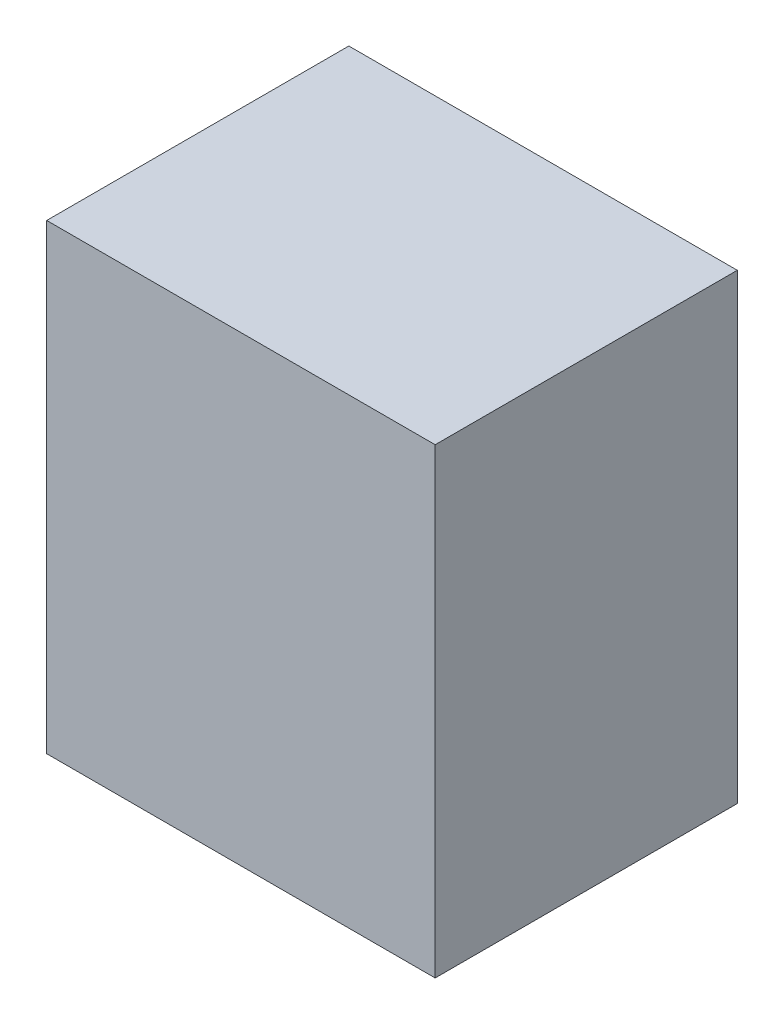
ISO-10303-21;
HEADER;
FILE_DESCRIPTION(('STEP AP214'),'2;1');
FILE_NAME('part.step','',(''),(''),'','','');
FILE_SCHEMA(('AUTOMOTIVE_DESIGN { 1 0 10303 214 1 1 1 1 }'));
ENDSEC;
DATA;
#1=APPLICATION_CONTEXT('core data for automotive mechanical design processes');
#2=APPLICATION_PROTOCOL_DEFINITION('international standard','automotive_design',2000,#1);
#3=PRODUCT_CONTEXT('',#1,'mechanical');
#4=PRODUCT('Part','Part','',(#3));
#5=PRODUCT_RELATED_PRODUCT_CATEGORY('part','',(#4));
#6=PRODUCT_DEFINITION_FORMATION('','',#4);
#7=PRODUCT_DEFINITION_CONTEXT('part definition',#1,'design');
#8=PRODUCT_DEFINITION('design','',#6,#7);
#9=PRODUCT_DEFINITION_SHAPE('','',#8);
#10=(LENGTH_UNIT() NAMED_UNIT(*) SI_UNIT(.MILLI.,.METRE.));
#11=(NAMED_UNIT(*) PLANE_ANGLE_UNIT() SI_UNIT($,.RADIAN.));
#12=(NAMED_UNIT(*) SI_UNIT($,.STERADIAN.) SOLID_ANGLE_UNIT());
#13=UNCERTAINTY_MEASURE_WITH_UNIT(LENGTH_MEASURE(1.E-05),#10,'distance_accuracy_value','');
#14=(GEOMETRIC_REPRESENTATION_CONTEXT(3) GLOBAL_UNCERTAINTY_ASSIGNED_CONTEXT((#13)) GLOBAL_UNIT_ASSIGNED_CONTEXT((#10,
#11,#12)) REPRESENTATION_CONTEXT('',''));
#15=CARTESIAN_POINT('',(0.,0.,0.));
#16=DIRECTION('',(0.,0.,1.));
#17=DIRECTION('',(1.,0.,0.));
#18=AXIS2_PLACEMENT_3D('',#15,#16,#17);
#19=CARTESIAN_POINT('',(0.,107.,0.));
#20=DIRECTION('',(1.,0.,0.));
#21=DIRECTION('',(0.,0.,-1.));
#22=AXIS2_PLACEMENT_3D('',#19,#20,#21);
#23=PLANE('',#22);
#24=DIRECTION('',(0.,0.,1.));
#25=VECTOR('',#24,1.);
#26=CARTESIAN_POINT('',(0.,0.,0.));
#27=LINE('',#26,#25);
#28=CARTESIAN_POINT('',(0.,0.,-70.));
#29=VERTEX_POINT('',#28);
#30=CARTESIAN_POINT('',(0.,0.,0.));
#31=VERTEX_POINT('',#30);
#32=EDGE_CURVE('E111',#29,#31,#27,.T.);
#33=ORIENTED_EDGE('',*,*,#32,.T.);
#34=DIRECTION('',(0.,-1.,0.));
#35=VECTOR('',#34,1.);
#36=CARTESIAN_POINT('',(0.,107.,0.));
#37=LINE('',#36,#35);
#38=CARTESIAN_POINT('',(0.,107.,0.));
#39=VERTEX_POINT('',#38);
#40=EDGE_CURVE('E11',#39,#31,#37,.T.);
#41=ORIENTED_EDGE('',*,*,#40,.F.);
#42=DIRECTION('',(0.,0.,1.));
#43=VECTOR('',#42,1.);
#44=CARTESIAN_POINT('',(0.,107.,0.));
#45=LINE('',#44,#43);
#46=CARTESIAN_POINT('',(0.,107.,-70.));
#47=VERTEX_POINT('',#46);
#48=EDGE_CURVE('E95',#47,#39,#45,.T.);
#49=ORIENTED_EDGE('',*,*,#48,.F.);
#50=DIRECTION('',(0.,-1.,0.));
#51=VECTOR('',#50,1.);
#52=CARTESIAN_POINT('',(0.,107.,-70.));
#53=LINE('',#52,#51);
#54=EDGE_CURVE('E107',#47,#29,#53,.T.);
#55=ORIENTED_EDGE('',*,*,#54,.T.);
#56=EDGE_LOOP('',(#33,#41,#49,#55));
#57=FACE_BOUND('',#56,.T.);
#58=ADVANCED_FACE('F43',(#57),#23,.F.);
#59=CARTESIAN_POINT('',(0.,107.,0.));
#60=DIRECTION('',(0.,0.,-1.));
#61=DIRECTION('',(-1.,0.,0.));
#62=AXIS2_PLACEMENT_3D('',#59,#60,#61);
#63=PLANE('',#62);
#64=DIRECTION('',(1.,0.,0.));
#65=VECTOR('',#64,1.);
#66=CARTESIAN_POINT('',(0.,0.,0.));
#67=LINE('',#66,#65);
#68=CARTESIAN_POINT('',(90.,0.,0.));
#69=VERTEX_POINT('',#68);
#70=EDGE_CURVE('E100',#31,#69,#67,.T.);
#71=ORIENTED_EDGE('',*,*,#70,.T.);
#72=DIRECTION('',(0.,-1.,0.));
#73=VECTOR('',#72,1.);
#74=CARTESIAN_POINT('',(90.,107.,0.));
#75=LINE('',#74,#73);
#76=CARTESIAN_POINT('',(90.,107.,0.));
#77=VERTEX_POINT('',#76);
#78=EDGE_CURVE('E52',#77,#69,#75,.T.);
#79=ORIENTED_EDGE('',*,*,#78,.F.);
#80=DIRECTION('',(1.,0.,0.));
#81=VECTOR('',#80,1.);
#82=CARTESIAN_POINT('',(0.,107.,0.));
#83=LINE('',#82,#81);
#84=EDGE_CURVE('E90',#39,#77,#83,.T.);
#85=ORIENTED_EDGE('',*,*,#84,.F.);
#86=ORIENTED_EDGE('',*,*,#40,.T.);
#87=EDGE_LOOP('',(#71,#79,#85,#86));
#88=FACE_BOUND('',#87,.T.);
#89=ADVANCED_FACE('F99',(#88),#63,.F.);
#90=CARTESIAN_POINT('',(90.,107.,0.));
#91=DIRECTION('',(-1.,0.,0.));
#92=DIRECTION('',(0.,0.,1.));
#93=AXIS2_PLACEMENT_3D('',#90,#91,#92);
#94=PLANE('',#93);
#95=DIRECTION('',(0.,0.,-1.));
#96=VECTOR('',#95,1.);
#97=CARTESIAN_POINT('',(90.,0.,0.));
#98=LINE('',#97,#96);
#99=CARTESIAN_POINT('',(90.,0.,-70.));
#100=VERTEX_POINT('',#99);
#101=EDGE_CURVE('E77',#69,#100,#98,.T.);
#102=ORIENTED_EDGE('',*,*,#101,.T.);
#103=DIRECTION('',(0.,-1.,0.));
#104=VECTOR('',#103,1.);
#105=CARTESIAN_POINT('',(90.,107.,-70.));
#106=LINE('',#105,#104);
#107=CARTESIAN_POINT('',(90.,107.,-70.));
#108=VERTEX_POINT('',#107);
#109=EDGE_CURVE('E102',#108,#100,#106,.T.);
#110=ORIENTED_EDGE('',*,*,#109,.F.);
#111=DIRECTION('',(0.,0.,-1.));
#112=VECTOR('',#111,1.);
#113=CARTESIAN_POINT('',(90.,107.,0.));
#114=LINE('',#113,#112);
#115=EDGE_CURVE('E93',#77,#108,#114,.T.);
#116=ORIENTED_EDGE('',*,*,#115,.F.);
#117=ORIENTED_EDGE('',*,*,#78,.T.);
#118=EDGE_LOOP('',(#102,#110,#116,#117));
#119=FACE_BOUND('',#118,.T.);
#120=ADVANCED_FACE('F103',(#119),#94,.F.);
#121=CARTESIAN_POINT('',(0.,107.,-70.));
#122=DIRECTION('',(0.,0.,1.));
#123=DIRECTION('',(1.,0.,0.));
#124=AXIS2_PLACEMENT_3D('',#121,#122,#123);
#125=PLANE('',#124);
#126=DIRECTION('',(-1.,0.,0.));
#127=VECTOR('',#126,1.);
#128=CARTESIAN_POINT('',(0.,0.,-70.));
#129=LINE('',#128,#127);
#130=EDGE_CURVE('E83',#100,#29,#129,.T.);
#131=ORIENTED_EDGE('',*,*,#130,.T.);
#132=ORIENTED_EDGE('',*,*,#54,.F.);
#133=DIRECTION('',(-1.,0.,0.));
#134=VECTOR('',#133,1.);
#135=CARTESIAN_POINT('',(0.,107.,-70.));
#136=LINE('',#135,#134);
#137=EDGE_CURVE('E60',#108,#47,#136,.T.);
#138=ORIENTED_EDGE('',*,*,#137,.F.);
#139=ORIENTED_EDGE('',*,*,#109,.T.);
#140=EDGE_LOOP('',(#131,#132,#138,#139));
#141=FACE_BOUND('',#140,.T.);
#142=ADVANCED_FACE('F124',(#141),#125,.F.);
#143=CARTESIAN_POINT('',(0.,107.,0.));
#144=DIRECTION('',(0.,-1.,0.));
#145=DIRECTION('',(0.,0.,-1.));
#146=AXIS2_PLACEMENT_3D('',#143,#144,#145);
#147=PLANE('',#146);
#148=ORIENTED_EDGE('',*,*,#48,.T.);
#149=ORIENTED_EDGE('',*,*,#84,.T.);
#150=ORIENTED_EDGE('',*,*,#115,.T.);
#151=ORIENTED_EDGE('',*,*,#137,.T.);
#152=EDGE_LOOP('',(#148,#149,#150,#151));
#153=FACE_BOUND('',#152,.T.);
#154=ADVANCED_FACE('F91',(#153),#147,.F.);
#155=CARTESIAN_POINT('',(0.,0.,0.));
#156=DIRECTION('',(0.,-1.,0.));
#157=DIRECTION('',(0.,0.,-1.));
#158=AXIS2_PLACEMENT_3D('',#155,#156,#157);
#159=PLANE('',#158);
#160=ORIENTED_EDGE('',*,*,#32,.F.);
#161=ORIENTED_EDGE('',*,*,#130,.F.);
#162=ORIENTED_EDGE('',*,*,#101,.F.);
#163=ORIENTED_EDGE('',*,*,#70,.F.);
#164=EDGE_LOOP('',(#160,#161,#162,#163));
#165=FACE_BOUND('',#164,.T.);
#166=ADVANCED_FACE('F127',(#165),#159,.T.);
#167=CLOSED_SHELL('',(#58,#89,#120,#142,#154,#166));
#168=MANIFOLD_SOLID_BREP('B2',#167);
#169=ADVANCED_BREP_SHAPE_REPRESENTATION('',(#18,#168),#14);
#170=SHAPE_DEFINITION_REPRESENTATION(#9,#169);
ENDSEC;
END-ISO-10303-21;
